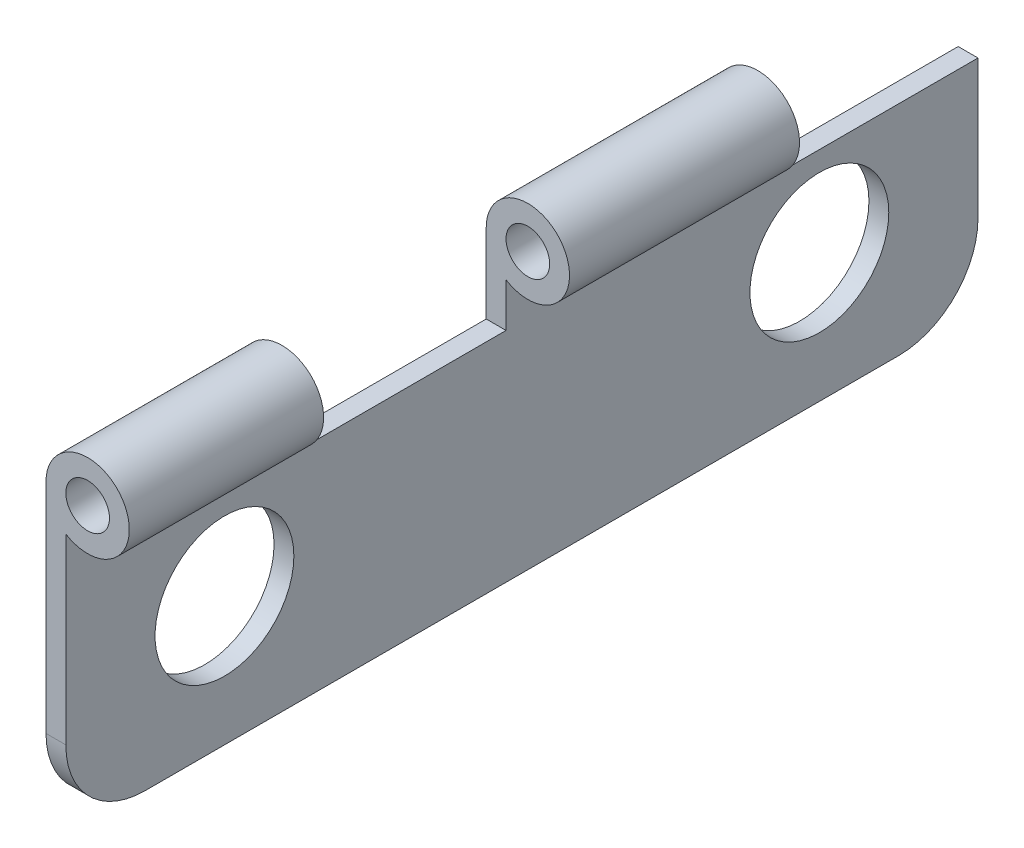
ISO-10303-21;
HEADER;
FILE_DESCRIPTION(('STEP AP214'),'2;1');
FILE_NAME('part.step','',(''),(''),'','','');
FILE_SCHEMA(('AUTOMOTIVE_DESIGN { 1 0 10303 214 1 1 1 1 }'));
ENDSEC;
DATA;
#1=APPLICATION_CONTEXT('core data for automotive mechanical design processes');
#2=APPLICATION_PROTOCOL_DEFINITION('international standard','automotive_design',2000,#1);
#3=PRODUCT_CONTEXT('',#1,'mechanical');
#4=PRODUCT('Part','Part','',(#3));
#5=PRODUCT_RELATED_PRODUCT_CATEGORY('part','',(#4));
#6=PRODUCT_DEFINITION_FORMATION('','',#4);
#7=PRODUCT_DEFINITION_CONTEXT('part definition',#1,'design');
#8=PRODUCT_DEFINITION('design','',#6,#7);
#9=PRODUCT_DEFINITION_SHAPE('','',#8);
#10=(LENGTH_UNIT() NAMED_UNIT(*) SI_UNIT(.MILLI.,.METRE.));
#11=(NAMED_UNIT(*) PLANE_ANGLE_UNIT() SI_UNIT($,.RADIAN.));
#12=(NAMED_UNIT(*) SI_UNIT($,.STERADIAN.) SOLID_ANGLE_UNIT());
#13=UNCERTAINTY_MEASURE_WITH_UNIT(LENGTH_MEASURE(1.E-05),#10,'distance_accuracy_value','');
#14=(GEOMETRIC_REPRESENTATION_CONTEXT(3) GLOBAL_UNCERTAINTY_ASSIGNED_CONTEXT((#13)) GLOBAL_UNIT_ASSIGNED_CONTEXT((#10,
#11,#12)) REPRESENTATION_CONTEXT('',''));
#15=CARTESIAN_POINT('',(0.,0.,0.));
#16=DIRECTION('',(0.,0.,1.));
#17=DIRECTION('',(1.,0.,0.));
#18=AXIS2_PLACEMENT_3D('',#15,#16,#17);
#19=CARTESIAN_POINT('',(0.,0.,11.9));
#20=DIRECTION('',(0.,0.,-1.));
#21=DIRECTION('',(-1.,0.,0.));
#22=AXIS2_PLACEMENT_3D('',#19,#20,#21);
#23=PLANE('',#22);
#24=CARTESIAN_POINT('',(0.,0.,11.9));
#25=DIRECTION('',(0.,0.,-1.));
#26=DIRECTION('',(-1.,0.,0.));
#27=AXIS2_PLACEMENT_3D('',#24,#25,#26);
#28=CIRCLE('',#27,0.55);
#29=CARTESIAN_POINT('',(-0.55,0.,11.9));
#30=VERTEX_POINT('',#29);
#31=EDGE_CURVE('E188',#30,#30,#28,.T.);
#32=ORIENTED_EDGE('',*,*,#31,.T.);
#33=EDGE_LOOP('',(#32));
#34=FACE_BOUND('',#33,.T.);
#35=DIRECTION('',(-1.,0.,0.));
#36=VECTOR('',#35,1.);
#37=CARTESIAN_POINT('',(0.,-2.,11.9));
#38=LINE('',#37,#36);
#39=CARTESIAN_POINT('',(-0.55,-2.,11.9));
#40=VERTEX_POINT('',#39);
#41=CARTESIAN_POINT('',(-1.05,-2.,11.9));
#42=VERTEX_POINT('',#41);
#43=EDGE_CURVE('E164',#40,#42,#38,.T.);
#44=ORIENTED_EDGE('',*,*,#43,.F.);
#45=DIRECTION('',(0.,-1.,0.));
#46=VECTOR('',#45,1.);
#47=CARTESIAN_POINT('',(-0.550000000000002,-7.5,11.9));
#48=LINE('',#47,#46);
#49=CARTESIAN_POINT('',(-0.549999999999999,-0.894427190999916,11.9));
#50=VERTEX_POINT('',#49);
#51=EDGE_CURVE('E191',#50,#40,#48,.T.);
#52=ORIENTED_EDGE('',*,*,#51,.F.);
#53=CARTESIAN_POINT('',(0.,0.,11.9));
#54=DIRECTION('',(0.,0.,-1.));
#55=DIRECTION('',(-1.,0.,0.));
#56=AXIS2_PLACEMENT_3D('',#53,#54,#55);
#57=CIRCLE('',#56,1.05);
#58=CARTESIAN_POINT('',(-1.05,0.,11.9));
#59=VERTEX_POINT('',#58);
#60=EDGE_CURVE('E196',#59,#50,#57,.T.);
#61=ORIENTED_EDGE('',*,*,#60,.F.);
#62=DIRECTION('',(0.,1.,0.));
#63=VECTOR('',#62,1.);
#64=CARTESIAN_POINT('',(-1.05,0.,11.9));
#65=LINE('',#64,#63);
#66=EDGE_CURVE('E194',#42,#59,#65,.T.);
#67=ORIENTED_EDGE('',*,*,#66,.F.);
#68=EDGE_LOOP('',(#44,#52,#61,#67));
#69=FACE_BOUND('',#68,.T.);
#70=ADVANCED_FACE('F32',(#34,#69),#23,.F.);
#71=CARTESIAN_POINT('',(0.,0.,6.1));
#72=DIRECTION('',(0.,0.,-1.));
#73=DIRECTION('',(-1.,0.,0.));
#74=AXIS2_PLACEMENT_3D('',#71,#72,#73);
#75=PLANE('',#74);
#76=CARTESIAN_POINT('',(0.,0.,6.1));
#77=DIRECTION('',(0.,0.,-1.));
#78=DIRECTION('',(-1.,0.,0.));
#79=AXIS2_PLACEMENT_3D('',#76,#77,#78);
#80=CIRCLE('',#79,0.55);
#81=CARTESIAN_POINT('',(-0.55,0.,6.1));
#82=VERTEX_POINT('',#81);
#83=EDGE_CURVE('E179',#82,#82,#80,.T.);
#84=ORIENTED_EDGE('',*,*,#83,.F.);
#85=EDGE_LOOP('',(#84));
#86=FACE_BOUND('',#85,.T.);
#87=DIRECTION('',(0.,-1.,0.));
#88=VECTOR('',#87,1.);
#89=CARTESIAN_POINT('',(-0.550000000000002,-7.5,6.1));
#90=LINE('',#89,#88);
#91=CARTESIAN_POINT('',(-0.549999999999999,-0.894427190999916,6.1));
#92=VERTEX_POINT('',#91);
#93=CARTESIAN_POINT('',(-0.549999999999999,-2.,6.1));
#94=VERTEX_POINT('',#93);
#95=EDGE_CURVE('E185',#92,#94,#90,.T.);
#96=ORIENTED_EDGE('',*,*,#95,.T.);
#97=DIRECTION('',(-1.,0.,0.));
#98=VECTOR('',#97,1.);
#99=CARTESIAN_POINT('',(0.,-2.,6.1));
#100=LINE('',#99,#98);
#101=CARTESIAN_POINT('',(-1.05,-2.,6.1));
#102=VERTEX_POINT('',#101);
#103=EDGE_CURVE('E209',#94,#102,#100,.T.);
#104=ORIENTED_EDGE('',*,*,#103,.T.);
#105=DIRECTION('',(0.,1.,0.));
#106=VECTOR('',#105,1.);
#107=CARTESIAN_POINT('',(-1.05,0.,6.1));
#108=LINE('',#107,#106);
#109=CARTESIAN_POINT('',(-1.05,0.,6.1));
#110=VERTEX_POINT('',#109);
#111=EDGE_CURVE('E183',#102,#110,#108,.T.);
#112=ORIENTED_EDGE('',*,*,#111,.T.);
#113=CARTESIAN_POINT('',(0.,0.,6.1));
#114=DIRECTION('',(0.,0.,-1.));
#115=DIRECTION('',(-1.,0.,0.));
#116=AXIS2_PLACEMENT_3D('',#113,#114,#115);
#117=CIRCLE('',#116,1.05);
#118=EDGE_CURVE('E180',#110,#92,#117,.T.);
#119=ORIENTED_EDGE('',*,*,#118,.T.);
#120=EDGE_LOOP('',(#96,#104,#112,#119));
#121=FACE_BOUND('',#120,.T.);
#122=ADVANCED_FACE('F260',(#86,#121),#75,.T.);
#123=CARTESIAN_POINT('',(0.,0.,-2.80411835449751));
#124=DIRECTION('',(0.,0.,1.));
#125=DIRECTION('',(1.,0.,0.));
#126=AXIS2_PLACEMENT_3D('',#123,#124,#125);
#127=CYLINDRICAL_SURFACE('',#126,1.05);
#128=ORIENTED_EDGE('',*,*,#118,.F.);
#129=DIRECTION('',(0.,0.,1.));
#130=VECTOR('',#129,1.);
#131=CARTESIAN_POINT('',(-1.05,0.,-2.80411835449751));
#132=LINE('',#131,#130);
#133=EDGE_CURVE('E201',#110,#59,#132,.T.);
#134=ORIENTED_EDGE('',*,*,#133,.T.);
#135=ORIENTED_EDGE('',*,*,#60,.T.);
#136=DIRECTION('',(0.,0.,1.));
#137=VECTOR('',#136,1.);
#138=CARTESIAN_POINT('',(-0.549999999999999,-0.894427190999916,-2.80411835449751));
#139=LINE('',#138,#137);
#140=EDGE_CURVE('E199',#92,#50,#139,.T.);
#141=ORIENTED_EDGE('',*,*,#140,.F.);
#142=EDGE_LOOP('',(#128,#134,#135,#141));
#143=FACE_BOUND('',#142,.T.);
#144=ADVANCED_FACE('F256',(#143),#127,.T.);
#145=CARTESIAN_POINT('',(-1.05,0.,-2.80411835449751));
#146=DIRECTION('',(1.,0.,0.));
#147=DIRECTION('',(0.,1.,0.));
#148=AXIS2_PLACEMENT_3D('',#145,#146,#147);
#149=PLANE('',#148);
#150=CARTESIAN_POINT('',(-1.05,-4.25,19.));
#151=DIRECTION('',(1.,0.,0.));
#152=DIRECTION('',(0.,0.,-1.));
#153=AXIS2_PLACEMENT_3D('',#150,#151,#152);
#154=CIRCLE('',#153,1.75);
#155=CARTESIAN_POINT('',(-1.05,-4.25,17.25));
#156=VERTEX_POINT('',#155);
#157=EDGE_CURVE('E156',#156,#156,#154,.T.);
#158=ORIENTED_EDGE('',*,*,#157,.T.);
#159=EDGE_LOOP('',(#158));
#160=FACE_BOUND('',#159,.T.);
#161=CARTESIAN_POINT('',(-1.05,-4.25,4.));
#162=DIRECTION('',(1.,0.,0.));
#163=DIRECTION('',(0.,0.,-1.));
#164=AXIS2_PLACEMENT_3D('',#161,#162,#163);
#165=CIRCLE('',#164,1.75);
#166=CARTESIAN_POINT('',(-1.05,-4.25,2.25));
#167=VERTEX_POINT('',#166);
#168=EDGE_CURVE('E323',#167,#167,#165,.T.);
#169=ORIENTED_EDGE('',*,*,#168,.T.);
#170=EDGE_LOOP('',(#169));
#171=FACE_BOUND('',#170,.T.);
#172=DIRECTION('',(0.,1.,0.));
#173=VECTOR('',#172,1.);
#174=CARTESIAN_POINT('',(-1.05,-2.,0.));
#175=LINE('',#174,#173);
#176=CARTESIAN_POINT('',(-1.05,-5.5,0.));
#177=VERTEX_POINT('',#176);
#178=CARTESIAN_POINT('',(-1.05,-2.,0.));
#179=VERTEX_POINT('',#178);
#180=EDGE_CURVE('E162',#177,#179,#175,.T.);
#181=ORIENTED_EDGE('',*,*,#180,.F.);
#182=CARTESIAN_POINT('',(-1.05,-5.5,2.));
#183=DIRECTION('',(1.,0.,0.));
#184=DIRECTION('',(0.,1.,0.));
#185=AXIS2_PLACEMENT_3D('',#182,#183,#184);
#186=CIRCLE('',#185,2.);
#187=CARTESIAN_POINT('',(-1.05,-7.5,2.));
#188=VERTEX_POINT('',#187);
#189=EDGE_CURVE('E219',#177,#188,#186,.F.);
#190=ORIENTED_EDGE('',*,*,#189,.T.);
#191=DIRECTION('',(0.,0.,1.));
#192=VECTOR('',#191,1.);
#193=CARTESIAN_POINT('',(-1.05,-7.5,-2.80411835449751));
#194=LINE('',#193,#192);
#195=CARTESIAN_POINT('',(-1.05,-7.5,21.));
#196=VERTEX_POINT('',#195);
#197=EDGE_CURVE('E204',#188,#196,#194,.T.);
#198=ORIENTED_EDGE('',*,*,#197,.T.);
#199=CARTESIAN_POINT('',(-1.05,-5.5,21.));
#200=DIRECTION('',(1.,0.,0.));
#201=DIRECTION('',(0.,1.,0.));
#202=AXIS2_PLACEMENT_3D('',#199,#200,#201);
#203=CIRCLE('',#202,2.);
#204=CARTESIAN_POINT('',(-1.05,-5.5,23.));
#205=VERTEX_POINT('',#204);
#206=EDGE_CURVE('E217',#196,#205,#203,.F.);
#207=ORIENTED_EDGE('',*,*,#206,.T.);
#208=DIRECTION('',(0.,-1.,0.));
#209=VECTOR('',#208,1.);
#210=CARTESIAN_POINT('',(-1.05,0.,23.));
#211=LINE('',#210,#209);
#212=CARTESIAN_POINT('',(-1.05,0.,23.));
#213=VERTEX_POINT('',#212);
#214=EDGE_CURVE('E127',#213,#205,#211,.T.);
#215=ORIENTED_EDGE('',*,*,#214,.F.);
#216=DIRECTION('',(0.,0.,1.));
#217=VECTOR('',#216,1.);
#218=CARTESIAN_POINT('',(-1.05,0.,9.19588164550249));
#219=LINE('',#218,#217);
#220=CARTESIAN_POINT('',(-1.05,0.,18.1));
#221=VERTEX_POINT('',#220);
#222=EDGE_CURVE('E141',#221,#213,#219,.T.);
#223=ORIENTED_EDGE('',*,*,#222,.F.);
#224=DIRECTION('',(0.,-1.,0.));
#225=VECTOR('',#224,1.);
#226=CARTESIAN_POINT('',(-1.05,0.,18.1));
#227=LINE('',#226,#225);
#228=CARTESIAN_POINT('',(-1.05,-2.,18.1));
#229=VERTEX_POINT('',#228);
#230=EDGE_CURVE('E137',#221,#229,#227,.T.);
#231=ORIENTED_EDGE('',*,*,#230,.T.);
#232=DIRECTION('',(0.,0.,1.));
#233=VECTOR('',#232,1.);
#234=CARTESIAN_POINT('',(-1.05,-2.,-5.52268050859363));
#235=LINE('',#234,#233);
#236=EDGE_CURVE('E173',#42,#229,#235,.T.);
#237=ORIENTED_EDGE('',*,*,#236,.F.);
#238=ORIENTED_EDGE('',*,*,#66,.T.);
#239=ORIENTED_EDGE('',*,*,#133,.F.);
#240=ORIENTED_EDGE('',*,*,#111,.F.);
#241=EDGE_CURVE('E171',#179,#102,#235,.T.);
#242=ORIENTED_EDGE('',*,*,#241,.F.);
#243=EDGE_LOOP('',(#181,#190,#198,#207,#215,#223,#231,#237,#238,#239,#240,#242));
#244=FACE_BOUND('',#243,.T.);
#245=ADVANCED_FACE('F237',(#160,#171,#244),#149,.F.);
#246=CARTESIAN_POINT('',(-0.550000000000002,-7.5,-2.80411835449751));
#247=DIRECTION('',(0.,1.,0.));
#248=DIRECTION('',(0.,0.,1.));
#249=AXIS2_PLACEMENT_3D('',#246,#247,#248);
#250=PLANE('',#249);
#251=ORIENTED_EDGE('',*,*,#197,.F.);
#252=DIRECTION('',(-1.,0.,0.));
#253=VECTOR('',#252,1.);
#254=CARTESIAN_POINT('',(-0.55,-7.5,2.));
#255=LINE('',#254,#253);
#256=CARTESIAN_POINT('',(-0.550000000000002,-7.5,2.));
#257=VERTEX_POINT('',#256);
#258=EDGE_CURVE('E223',#188,#257,#255,.F.);
#259=ORIENTED_EDGE('',*,*,#258,.T.);
#260=DIRECTION('',(0.,0.,1.));
#261=VECTOR('',#260,1.);
#262=CARTESIAN_POINT('',(-0.550000000000002,-7.5,-2.80411835449751));
#263=LINE('',#262,#261);
#264=CARTESIAN_POINT('',(-0.550000000000002,-7.5,21.));
#265=VERTEX_POINT('',#264);
#266=EDGE_CURVE('E207',#257,#265,#263,.T.);
#267=ORIENTED_EDGE('',*,*,#266,.T.);
#268=DIRECTION('',(1.,0.,0.));
#269=VECTOR('',#268,1.);
#270=CARTESIAN_POINT('',(-1.05,-7.5,21.));
#271=LINE('',#270,#269);
#272=EDGE_CURVE('E221',#265,#196,#271,.F.);
#273=ORIENTED_EDGE('',*,*,#272,.T.);
#274=EDGE_LOOP('',(#251,#259,#267,#273));
#275=FACE_BOUND('',#274,.T.);
#276=ADVANCED_FACE('F241',(#275),#250,.F.);
#277=CARTESIAN_POINT('',(-0.550000000000002,-7.5,-2.80411835449751));
#278=DIRECTION('',(-1.,0.,0.));
#279=DIRECTION('',(0.,-1.,0.));
#280=AXIS2_PLACEMENT_3D('',#277,#278,#279);
#281=PLANE('',#280);
#282=CARTESIAN_POINT('',(-0.55,-4.25,19.));
#283=DIRECTION('',(1.,0.,0.));
#284=DIRECTION('',(0.,0.,-1.));
#285=AXIS2_PLACEMENT_3D('',#282,#283,#284);
#286=CIRCLE('',#285,1.75);
#287=CARTESIAN_POINT('',(-0.55,-4.25,17.25));
#288=VERTEX_POINT('',#287);
#289=EDGE_CURVE('E322',#288,#288,#286,.T.);
#290=ORIENTED_EDGE('',*,*,#289,.F.);
#291=EDGE_LOOP('',(#290));
#292=FACE_BOUND('',#291,.T.);
#293=CARTESIAN_POINT('',(-0.55,-4.25,4.));
#294=DIRECTION('',(1.,0.,0.));
#295=DIRECTION('',(0.,0.,-1.));
#296=AXIS2_PLACEMENT_3D('',#293,#294,#295);
#297=CIRCLE('',#296,1.75);
#298=CARTESIAN_POINT('',(-0.55,-4.25,2.25));
#299=VERTEX_POINT('',#298);
#300=EDGE_CURVE('E327',#299,#299,#297,.T.);
#301=ORIENTED_EDGE('',*,*,#300,.F.);
#302=EDGE_LOOP('',(#301));
#303=FACE_BOUND('',#302,.T.);
#304=ORIENTED_EDGE('',*,*,#266,.F.);
#305=CARTESIAN_POINT('',(-0.550000000000001,-5.5,2.));
#306=DIRECTION('',(-1.,0.,0.));
#307=DIRECTION('',(0.,-1.,0.));
#308=AXIS2_PLACEMENT_3D('',#305,#306,#307);
#309=CIRCLE('',#308,2.);
#310=CARTESIAN_POINT('',(-0.55,-5.5,0.));
#311=VERTEX_POINT('',#310);
#312=EDGE_CURVE('E40',#257,#311,#309,.F.);
#313=ORIENTED_EDGE('',*,*,#312,.T.);
#314=DIRECTION('',(0.,-1.,0.));
#315=VECTOR('',#314,1.);
#316=CARTESIAN_POINT('',(-0.549999999999999,-2.,0.));
#317=LINE('',#316,#315);
#318=CARTESIAN_POINT('',(-0.549999999999999,-2.,0.));
#319=VERTEX_POINT('',#318);
#320=EDGE_CURVE('E165',#319,#311,#317,.T.);
#321=ORIENTED_EDGE('',*,*,#320,.F.);
#322=DIRECTION('',(0.,0.,1.));
#323=VECTOR('',#322,1.);
#324=CARTESIAN_POINT('',(-0.549999999999999,-2.,-5.52268050859363));
#325=LINE('',#324,#323);
#326=EDGE_CURVE('E174',#319,#94,#325,.T.);
#327=ORIENTED_EDGE('',*,*,#326,.T.);
#328=ORIENTED_EDGE('',*,*,#95,.F.);
#329=ORIENTED_EDGE('',*,*,#140,.T.);
#330=ORIENTED_EDGE('',*,*,#51,.T.);
#331=CARTESIAN_POINT('',(-0.549999999999999,-2.,18.1));
#332=VERTEX_POINT('',#331);
#333=EDGE_CURVE('E161',#40,#332,#325,.T.);
#334=ORIENTED_EDGE('',*,*,#333,.T.);
#335=DIRECTION('',(0.,1.,0.));
#336=VECTOR('',#335,1.);
#337=CARTESIAN_POINT('',(-0.550000000000002,-7.5,18.1));
#338=LINE('',#337,#336);
#339=CARTESIAN_POINT('',(-0.549999999999999,-0.894427190999916,18.1));
#340=VERTEX_POINT('',#339);
#341=EDGE_CURVE('E133',#332,#340,#338,.T.);
#342=ORIENTED_EDGE('',*,*,#341,.T.);
#343=DIRECTION('',(0.,0.,1.));
#344=VECTOR('',#343,1.);
#345=CARTESIAN_POINT('',(-0.549999999999999,-0.894427190999916,9.19588164550249));
#346=LINE('',#345,#344);
#347=CARTESIAN_POINT('',(-0.549999999999999,-0.894427190999916,23.));
#348=VERTEX_POINT('',#347);
#349=EDGE_CURVE('E130',#340,#348,#346,.T.);
#350=ORIENTED_EDGE('',*,*,#349,.T.);
#351=DIRECTION('',(0.,1.,0.));
#352=VECTOR('',#351,1.);
#353=CARTESIAN_POINT('',(-0.550000000000002,-7.5,23.));
#354=LINE('',#353,#352);
#355=CARTESIAN_POINT('',(-0.550000000000001,-5.5,23.));
#356=VERTEX_POINT('',#355);
#357=EDGE_CURVE('E120',#356,#348,#354,.T.);
#358=ORIENTED_EDGE('',*,*,#357,.F.);
#359=CARTESIAN_POINT('',(-0.550000000000001,-5.5,21.));
#360=DIRECTION('',(-1.,0.,0.));
#361=DIRECTION('',(0.,-1.,0.));
#362=AXIS2_PLACEMENT_3D('',#359,#360,#361);
#363=CIRCLE('',#362,2.);
#364=EDGE_CURVE('E47',#356,#265,#363,.F.);
#365=ORIENTED_EDGE('',*,*,#364,.T.);
#366=EDGE_LOOP('',(#304,#313,#321,#327,#328,#329,#330,#334,#342,#350,#358,#365));
#367=FACE_BOUND('',#366,.T.);
#368=ADVANCED_FACE('F131',(#292,#303,#367),#281,.F.);
#369=CARTESIAN_POINT('',(0.,0.,-2.80411835449751));
#370=DIRECTION('',(0.,0.,1.));
#371=DIRECTION('',(1.,0.,0.));
#372=AXIS2_PLACEMENT_3D('',#369,#370,#371);
#373=CYLINDRICAL_SURFACE('',#372,0.55);
#374=ORIENTED_EDGE('',*,*,#31,.F.);
#375=EDGE_LOOP('',(#374));
#376=FACE_BOUND('',#375,.T.);
#377=ORIENTED_EDGE('',*,*,#83,.T.);
#378=EDGE_LOOP('',(#377));
#379=FACE_BOUND('',#378,.T.);
#380=ADVANCED_FACE('F269',(#376,#379),#373,.F.);
#381=CARTESIAN_POINT('',(0.,0.,0.));
#382=DIRECTION('',(0.,0.,-1.));
#383=DIRECTION('',(-1.,0.,0.));
#384=AXIS2_PLACEMENT_3D('',#381,#382,#383);
#385=PLANE('',#384);
#386=ORIENTED_EDGE('',*,*,#320,.T.);
#387=DIRECTION('',(-1.,0.,0.));
#388=VECTOR('',#387,1.);
#389=CARTESIAN_POINT('',(-1.05,-5.5,0.));
#390=LINE('',#389,#388);
#391=EDGE_CURVE('E214',#311,#177,#390,.T.);
#392=ORIENTED_EDGE('',*,*,#391,.T.);
#393=ORIENTED_EDGE('',*,*,#180,.T.);
#394=DIRECTION('',(1.,0.,0.));
#395=VECTOR('',#394,1.);
#396=CARTESIAN_POINT('',(-0.549999999999999,-2.,0.));
#397=LINE('',#396,#395);
#398=EDGE_CURVE('E168',#179,#319,#397,.T.);
#399=ORIENTED_EDGE('',*,*,#398,.T.);
#400=EDGE_LOOP('',(#386,#392,#393,#399));
#401=FACE_BOUND('',#400,.T.);
#402=ADVANCED_FACE('F231',(#401),#385,.T.);
#403=CARTESIAN_POINT('',(-0.549999999999999,-2.,-5.52268050859363));
#404=DIRECTION('',(0.,-1.,0.));
#405=DIRECTION('',(0.,0.,-1.));
#406=AXIS2_PLACEMENT_3D('',#403,#404,#405);
#407=PLANE('',#406);
#408=ORIENTED_EDGE('',*,*,#103,.F.);
#409=ORIENTED_EDGE('',*,*,#326,.F.);
#410=ORIENTED_EDGE('',*,*,#398,.F.);
#411=ORIENTED_EDGE('',*,*,#241,.T.);
#412=EDGE_LOOP('',(#408,#409,#410,#411));
#413=FACE_BOUND('',#412,.T.);
#414=ADVANCED_FACE('F262',(#413),#407,.F.);
#415=ORIENTED_EDGE('',*,*,#333,.F.);
#416=ORIENTED_EDGE('',*,*,#43,.T.);
#417=ORIENTED_EDGE('',*,*,#236,.T.);
#418=DIRECTION('',(-1.,0.,0.));
#419=VECTOR('',#418,1.);
#420=CARTESIAN_POINT('',(-0.549999999999999,-2.,18.1));
#421=LINE('',#420,#419);
#422=EDGE_CURVE('E151',#332,#229,#421,.T.);
#423=ORIENTED_EDGE('',*,*,#422,.F.);
#424=EDGE_LOOP('',(#415,#416,#417,#423));
#425=FACE_BOUND('',#424,.T.);
#426=ADVANCED_FACE('F249',(#425),#407,.F.);
#427=CARTESIAN_POINT('',(0.,0.,9.19588164550249));
#428=DIRECTION('',(0.,0.,1.));
#429=DIRECTION('',(1.,0.,0.));
#430=AXIS2_PLACEMENT_3D('',#427,#428,#429);
#431=CYLINDRICAL_SURFACE('',#430,1.05);
#432=ORIENTED_EDGE('',*,*,#349,.F.);
#433=CARTESIAN_POINT('',(0.,0.,18.1));
#434=DIRECTION('',(0.,0.,-1.));
#435=DIRECTION('',(-1.,0.,0.));
#436=AXIS2_PLACEMENT_3D('',#433,#434,#435);
#437=CIRCLE('',#436,1.05);
#438=EDGE_CURVE('E154',#340,#221,#437,.F.);
#439=ORIENTED_EDGE('',*,*,#438,.T.);
#440=ORIENTED_EDGE('',*,*,#222,.T.);
#441=CARTESIAN_POINT('',(0.,0.,23.));
#442=DIRECTION('',(0.,0.,1.));
#443=DIRECTION('',(1.,0.,0.));
#444=AXIS2_PLACEMENT_3D('',#441,#442,#443);
#445=CIRCLE('',#444,1.05);
#446=EDGE_CURVE('E125',#348,#213,#445,.T.);
#447=ORIENTED_EDGE('',*,*,#446,.F.);
#448=EDGE_LOOP('',(#432,#439,#440,#447));
#449=FACE_BOUND('',#448,.T.);
#450=ADVANCED_FACE('F139',(#449),#431,.T.);
#451=CARTESIAN_POINT('',(0.,0.,9.19588164550249));
#452=DIRECTION('',(0.,0.,1.));
#453=DIRECTION('',(1.,0.,0.));
#454=AXIS2_PLACEMENT_3D('',#451,#452,#453);
#455=CYLINDRICAL_SURFACE('',#454,0.55);
#456=CARTESIAN_POINT('',(0.,0.,23.));
#457=DIRECTION('',(0.,0.,1.));
#458=DIRECTION('',(1.,0.,0.));
#459=AXIS2_PLACEMENT_3D('',#456,#457,#458);
#460=CIRCLE('',#459,0.55);
#461=CARTESIAN_POINT('',(0.55,0.,23.));
#462=VERTEX_POINT('',#461);
#463=EDGE_CURVE('E143',#462,#462,#460,.T.);
#464=ORIENTED_EDGE('',*,*,#463,.T.);
#465=EDGE_LOOP('',(#464));
#466=FACE_BOUND('',#465,.T.);
#467=CARTESIAN_POINT('',(0.,0.,18.1));
#468=DIRECTION('',(0.,0.,-1.));
#469=DIRECTION('',(-1.,0.,0.));
#470=AXIS2_PLACEMENT_3D('',#467,#468,#469);
#471=CIRCLE('',#470,0.55);
#472=CARTESIAN_POINT('',(-0.55,0.,18.1));
#473=VERTEX_POINT('',#472);
#474=EDGE_CURVE('E126',#473,#473,#471,.F.);
#475=ORIENTED_EDGE('',*,*,#474,.F.);
#476=EDGE_LOOP('',(#475));
#477=FACE_BOUND('',#476,.T.);
#478=ADVANCED_FACE('F300',(#466,#477),#455,.F.);
#479=CARTESIAN_POINT('',(0.,0.,23.));
#480=DIRECTION('',(0.,0.,1.));
#481=DIRECTION('',(1.,0.,0.));
#482=AXIS2_PLACEMENT_3D('',#479,#480,#481);
#483=PLANE('',#482);
#484=ORIENTED_EDGE('',*,*,#463,.F.);
#485=EDGE_LOOP('',(#484));
#486=FACE_BOUND('',#485,.T.);
#487=ORIENTED_EDGE('',*,*,#214,.T.);
#488=DIRECTION('',(1.,0.,0.));
#489=VECTOR('',#488,1.);
#490=CARTESIAN_POINT('',(-0.550000000000002,-5.5,23.));
#491=LINE('',#490,#489);
#492=EDGE_CURVE('E11',#205,#356,#491,.T.);
#493=ORIENTED_EDGE('',*,*,#492,.T.);
#494=ORIENTED_EDGE('',*,*,#357,.T.);
#495=ORIENTED_EDGE('',*,*,#446,.T.);
#496=EDGE_LOOP('',(#487,#493,#494,#495));
#497=FACE_BOUND('',#496,.T.);
#498=ADVANCED_FACE('F123',(#486,#497),#483,.T.);
#499=CARTESIAN_POINT('',(0.,0.,18.1));
#500=DIRECTION('',(0.,0.,-1.));
#501=DIRECTION('',(-1.,0.,0.));
#502=AXIS2_PLACEMENT_3D('',#499,#500,#501);
#503=PLANE('',#502);
#504=ORIENTED_EDGE('',*,*,#341,.F.);
#505=ORIENTED_EDGE('',*,*,#422,.T.);
#506=ORIENTED_EDGE('',*,*,#230,.F.);
#507=ORIENTED_EDGE('',*,*,#438,.F.);
#508=EDGE_LOOP('',(#504,#505,#506,#507));
#509=FACE_BOUND('',#508,.T.);
#510=ORIENTED_EDGE('',*,*,#474,.T.);
#511=EDGE_LOOP('',(#510));
#512=FACE_BOUND('',#511,.T.);
#513=ADVANCED_FACE('F244',(#509,#512),#503,.T.);
#514=CARTESIAN_POINT('',(0.,-5.5,2.));
#515=DIRECTION('',(1.,0.,0.));
#516=DIRECTION('',(0.,0.,-1.));
#517=AXIS2_PLACEMENT_3D('',#514,#515,#516);
#518=CYLINDRICAL_SURFACE('',#517,2.);
#519=ORIENTED_EDGE('',*,*,#312,.F.);
#520=ORIENTED_EDGE('',*,*,#258,.F.);
#521=ORIENTED_EDGE('',*,*,#189,.F.);
#522=ORIENTED_EDGE('',*,*,#391,.F.);
#523=EDGE_LOOP('',(#519,#520,#521,#522));
#524=FACE_BOUND('',#523,.T.);
#525=ADVANCED_FACE('F234',(#524),#518,.T.);
#526=CARTESIAN_POINT('',(0.,-5.5,21.));
#527=DIRECTION('',(-1.,0.,0.));
#528=DIRECTION('',(0.,0.,1.));
#529=AXIS2_PLACEMENT_3D('',#526,#527,#528);
#530=CYLINDRICAL_SURFACE('',#529,2.);
#531=ORIENTED_EDGE('',*,*,#206,.F.);
#532=ORIENTED_EDGE('',*,*,#272,.F.);
#533=ORIENTED_EDGE('',*,*,#364,.F.);
#534=ORIENTED_EDGE('',*,*,#492,.F.);
#535=EDGE_LOOP('',(#531,#532,#533,#534));
#536=FACE_BOUND('',#535,.T.);
#537=ADVANCED_FACE('F34',(#536),#530,.T.);
#538=CARTESIAN_POINT('',(-1.05,-4.25,4.));
#539=DIRECTION('',(1.,0.,0.));
#540=DIRECTION('',(0.,0.,-1.));
#541=AXIS2_PLACEMENT_3D('',#538,#539,#540);
#542=CYLINDRICAL_SURFACE('',#541,1.75);
#543=ORIENTED_EDGE('',*,*,#168,.F.);
#544=EDGE_LOOP('',(#543));
#545=FACE_BOUND('',#544,.T.);
#546=ORIENTED_EDGE('',*,*,#300,.T.);
#547=EDGE_LOOP('',(#546));
#548=FACE_BOUND('',#547,.T.);
#549=ADVANCED_FACE('F296',(#545,#548),#542,.F.);
#550=CARTESIAN_POINT('',(-1.05,-4.25,19.));
#551=DIRECTION('',(1.,0.,0.));
#552=DIRECTION('',(0.,0.,-1.));
#553=AXIS2_PLACEMENT_3D('',#550,#551,#552);
#554=CYLINDRICAL_SURFACE('',#553,1.75);
#555=ORIENTED_EDGE('',*,*,#157,.F.);
#556=EDGE_LOOP('',(#555));
#557=FACE_BOUND('',#556,.T.);
#558=ORIENTED_EDGE('',*,*,#289,.T.);
#559=EDGE_LOOP('',(#558));
#560=FACE_BOUND('',#559,.T.);
#561=ADVANCED_FACE('F311',(#557,#560),#554,.F.);
#562=CLOSED_SHELL('',(#70,#122,#144,#245,#276,#368,#380,#402,#414,#426,#450,#478,#498,#513,#525,
#537,#549,#561));
#563=MANIFOLD_SOLID_BREP('B2',#562);
#564=ADVANCED_BREP_SHAPE_REPRESENTATION('',(#18,#563),#14);
#565=SHAPE_DEFINITION_REPRESENTATION(#9,#564);
ENDSEC;
END-ISO-10303-21;
